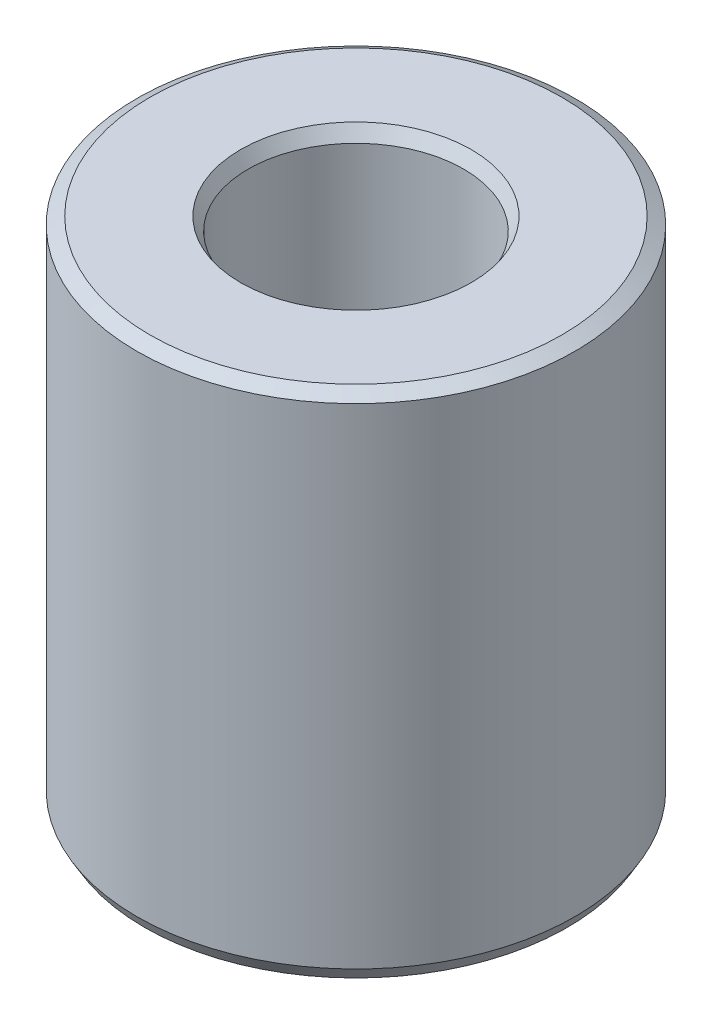
ISO-10303-21;
HEADER;
FILE_DESCRIPTION(('STEP AP214'),'2;1');
FILE_NAME('part.step','',(''),(''),'','','');
FILE_SCHEMA(('AUTOMOTIVE_DESIGN { 1 0 10303 214 1 1 1 1 }'));
ENDSEC;
DATA;
#1=APPLICATION_CONTEXT('core data for automotive mechanical design processes');
#2=APPLICATION_PROTOCOL_DEFINITION('international standard','automotive_design',2000,#1);
#3=PRODUCT_CONTEXT('',#1,'mechanical');
#4=PRODUCT('Part','Part','',(#3));
#5=PRODUCT_RELATED_PRODUCT_CATEGORY('part','',(#4));
#6=PRODUCT_DEFINITION_FORMATION('','',#4);
#7=PRODUCT_DEFINITION_CONTEXT('part definition',#1,'design');
#8=PRODUCT_DEFINITION('design','',#6,#7);
#9=PRODUCT_DEFINITION_SHAPE('','',#8);
#10=(LENGTH_UNIT() NAMED_UNIT(*) SI_UNIT(.MILLI.,.METRE.));
#11=(NAMED_UNIT(*) PLANE_ANGLE_UNIT() SI_UNIT($,.RADIAN.));
#12=(NAMED_UNIT(*) SI_UNIT($,.STERADIAN.) SOLID_ANGLE_UNIT());
#13=UNCERTAINTY_MEASURE_WITH_UNIT(LENGTH_MEASURE(1.E-05),#10,'distance_accuracy_value','');
#14=(GEOMETRIC_REPRESENTATION_CONTEXT(3) GLOBAL_UNCERTAINTY_ASSIGNED_CONTEXT((#13)) GLOBAL_UNIT_ASSIGNED_CONTEXT((#10,
#11,#12)) REPRESENTATION_CONTEXT('',''));
#15=CARTESIAN_POINT('',(0.,0.,0.));
#16=DIRECTION('',(0.,0.,1.));
#17=DIRECTION('',(1.,0.,0.));
#18=AXIS2_PLACEMENT_3D('',#15,#16,#17);
#19=CARTESIAN_POINT('',(0.,128.133976744386,0.));
#20=DIRECTION('',(0.,-1.,0.));
#21=DIRECTION('',(0.,0.,-1.));
#22=AXIS2_PLACEMENT_3D('',#19,#20,#21);
#23=CYLINDRICAL_SURFACE('',#22,55.);
#24=CARTESIAN_POINT('',(0.,3.2944253566551,0.));
#25=DIRECTION('',(0.,1.,0.));
#26=DIRECTION('',(0.,0.,1.));
#27=AXIS2_PLACEMENT_3D('',#24,#25,#26);
#28=CIRCLE('',#27,55.);
#29=CARTESIAN_POINT('',(0.,3.2944253566551,55.));
#30=VERTEX_POINT('',#29);
#31=EDGE_CURVE('E10',#30,#30,#28,.T.);
#32=ORIENTED_EDGE('',*,*,#31,.T.);
#33=EDGE_LOOP('',(#32));
#34=FACE_BOUND('',#33,.T.);
#35=CARTESIAN_POINT('',(0.,126.231939377896,0.));
#36=DIRECTION('',(0.,1.,0.));
#37=DIRECTION('',(0.,0.,1.));
#38=AXIS2_PLACEMENT_3D('',#35,#36,#37);
#39=CIRCLE('',#38,55.);
#40=CARTESIAN_POINT('',(0.,126.231939377896,55.));
#41=VERTEX_POINT('',#40);
#42=EDGE_CURVE('E50',#41,#41,#39,.F.);
#43=ORIENTED_EDGE('',*,*,#42,.T.);
#44=EDGE_LOOP('',(#43));
#45=FACE_BOUND('',#44,.T.);
#46=ADVANCED_FACE('F39',(#34,#45),#23,.T.);
#47=CARTESIAN_POINT('',(0.,128.133976744386,0.));
#48=DIRECTION('',(0.,1.,0.));
#49=DIRECTION('',(0.,0.,1.));
#50=AXIS2_PLACEMENT_3D('',#47,#48,#49);
#51=PLANE('',#50);
#52=CARTESIAN_POINT('',(0.,128.133976744386,0.));
#53=DIRECTION('',(0.,1.,0.));
#54=DIRECTION('',(0.,0.,1.));
#55=AXIS2_PLACEMENT_3D('',#52,#53,#54);
#56=CIRCLE('',#55,28.959207720593);
#57=CARTESIAN_POINT('',(0.,128.133976744386,28.959207720593));
#58=VERTEX_POINT('',#57);
#59=EDGE_CURVE('E58',#58,#58,#56,.F.);
#60=ORIENTED_EDGE('',*,*,#59,.T.);
#61=EDGE_LOOP('',(#60));
#62=FACE_BOUND('',#61,.T.);
#63=CARTESIAN_POINT('',(0.,128.133976744386,0.));
#64=DIRECTION('',(0.,1.,0.));
#65=DIRECTION('',(0.,0.,1.));
#66=AXIS2_PLACEMENT_3D('',#63,#64,#65);
#67=CIRCLE('',#66,51.7055746433449);
#68=CARTESIAN_POINT('',(0.,128.133976744386,51.7055746433449));
#69=VERTEX_POINT('',#68);
#70=EDGE_CURVE('E61',#69,#69,#67,.T.);
#71=ORIENTED_EDGE('',*,*,#70,.T.);
#72=EDGE_LOOP('',(#71));
#73=FACE_BOUND('',#72,.T.);
#74=ADVANCED_FACE('F88',(#62,#73),#51,.T.);
#75=CARTESIAN_POINT('',(0.,0.,0.));
#76=DIRECTION('',(0.,1.,0.));
#77=DIRECTION('',(0.,0.,1.));
#78=AXIS2_PLACEMENT_3D('',#75,#76,#77);
#79=PLANE('',#78);
#80=CARTESIAN_POINT('',(0.,0.,0.));
#81=DIRECTION('',(0.,1.,0.));
#82=DIRECTION('',(0.,0.,1.));
#83=AXIS2_PLACEMENT_3D('',#80,#81,#82);
#84=CIRCLE('',#83,30.3515957107582);
#85=CARTESIAN_POINT('',(0.,0.,30.3515957107582));
#86=VERTEX_POINT('',#85);
#87=EDGE_CURVE('E51',#86,#86,#84,.T.);
#88=ORIENTED_EDGE('',*,*,#87,.T.);
#89=EDGE_LOOP('',(#88));
#90=FACE_BOUND('',#89,.T.);
#91=CARTESIAN_POINT('',(0.,0.,0.));
#92=DIRECTION('',(0.,1.,0.));
#93=DIRECTION('',(0.,0.,1.));
#94=AXIS2_PLACEMENT_3D('',#91,#92,#93);
#95=CIRCLE('',#94,53.09796263351);
#96=CARTESIAN_POINT('',(0.,0.,53.09796263351));
#97=VERTEX_POINT('',#96);
#98=EDGE_CURVE('E54',#97,#97,#95,.F.);
#99=ORIENTED_EDGE('',*,*,#98,.T.);
#100=EDGE_LOOP('',(#99));
#101=FACE_BOUND('',#100,.T.);
#102=ADVANCED_FACE('F83',(#90,#101),#79,.F.);
#103=CARTESIAN_POINT('',(0.,128.133976744386,0.));
#104=DIRECTION('',(0.,-1.,0.));
#105=DIRECTION('',(0.,0.,-1.));
#106=AXIS2_PLACEMENT_3D('',#103,#104,#105);
#107=CYLINDRICAL_SURFACE('',#106,27.0571703541031);
#108=CARTESIAN_POINT('',(0.,124.839551387731,0.));
#109=DIRECTION('',(0.,1.,0.));
#110=DIRECTION('',(0.,0.,1.));
#111=AXIS2_PLACEMENT_3D('',#108,#109,#110);
#112=CIRCLE('',#111,27.0571703541031);
#113=CARTESIAN_POINT('',(0.,124.83955138773,27.0571703541031));
#114=VERTEX_POINT('',#113);
#115=EDGE_CURVE('E67',#114,#114,#112,.T.);
#116=ORIENTED_EDGE('',*,*,#115,.T.);
#117=EDGE_LOOP('',(#116));
#118=FACE_BOUND('',#117,.T.);
#119=CARTESIAN_POINT('',(0.,1.90203736648994,0.));
#120=DIRECTION('',(0.,1.,0.));
#121=DIRECTION('',(0.,0.,1.));
#122=AXIS2_PLACEMENT_3D('',#119,#120,#121);
#123=CIRCLE('',#122,27.0571703541031);
#124=CARTESIAN_POINT('',(0.,1.90203736648994,27.0571703541031));
#125=VERTEX_POINT('',#124);
#126=EDGE_CURVE('E69',#125,#125,#123,.F.);
#127=ORIENTED_EDGE('',*,*,#126,.T.);
#128=EDGE_LOOP('',(#127));
#129=FACE_BOUND('',#128,.T.);
#130=ADVANCED_FACE('F71',(#118,#129),#107,.F.);
#131=CARTESIAN_POINT('',(0.,124.839551387731,0.));
#132=DIRECTION('',(0.,1.,0.));
#133=DIRECTION('',(0.,0.,1.));
#134=AXIS2_PLACEMENT_3D('',#131,#132,#133);
#135=CONICAL_SURFACE('',#134,27.0571703541031,0.523598775598299);
#136=CARTESIAN_POINT('',(0.,128.133976744386,28.959207720593));
#137=CARTESIAN_POINT('',(0.,128.099659813587,28.9393948313588));
#138=CARTESIAN_POINT('',(0.,128.065342882789,28.9195819421245));
#139=CARTESIAN_POINT('',(0.,127.996709021192,28.8799561636559));
#140=CARTESIAN_POINT('',(0.,127.962392090393,28.8601432744217));
#141=CARTESIAN_POINT('',(0.,127.893758228796,28.8205174959531));
#142=CARTESIAN_POINT('',(0.,127.859441297998,28.8007046067189));
#143=CARTESIAN_POINT('',(0.,127.790807436401,28.7610788282503));
#144=CARTESIAN_POINT('',(0.,127.756490505602,28.741265939016));
#145=CARTESIAN_POINT('',(0.,127.687856644005,28.7016401605475));
#146=CARTESIAN_POINT('',(0.,127.653539713207,28.6818272713132));
#147=CARTESIAN_POINT('',(0.,127.58490585161,28.6422014928447));
#148=CARTESIAN_POINT('',(0.,127.550588920811,28.6223886036104));
#149=CARTESIAN_POINT('',(0.,127.481955059214,28.5827628251419));
#150=CARTESIAN_POINT('',(0.,127.447638128416,28.5629499359076));
#151=CARTESIAN_POINT('',(0.,127.379004266819,28.5233241574391));
#152=CARTESIAN_POINT('',(0.,127.34468733602,28.5035112682048));
#153=CARTESIAN_POINT('',(0.,127.276053474423,28.4638854897363));
#154=CARTESIAN_POINT('',(0.,127.241736543625,28.444072600502));
#155=CARTESIAN_POINT('',(0.,127.173102682028,28.4044468220335));
#156=CARTESIAN_POINT('',(0.,127.138785751229,28.3846339327992));
#157=CARTESIAN_POINT('',(0.,127.070151889632,28.3450081543306));
#158=CARTESIAN_POINT('',(0.,127.035834958834,28.3251952650964));
#159=CARTESIAN_POINT('',(0.,126.967201097237,28.2855694866278));
#160=CARTESIAN_POINT('',(0.,126.932884166438,28.2657565973936));
#161=CARTESIAN_POINT('',(0.,126.864250304841,28.226130818925));
#162=CARTESIAN_POINT('',(0.,126.829933374043,28.2063179296907));
#163=CARTESIAN_POINT('',(0.,126.761299512446,28.1666921512222));
#164=CARTESIAN_POINT('',(0.,126.726982581647,28.1468792619879));
#165=CARTESIAN_POINT('',(0.,126.65834872005,28.1072534835194));
#166=CARTESIAN_POINT('',(0.,126.624031789252,28.0874405942851));
#167=CARTESIAN_POINT('',(0.,126.555397927655,28.0478148158166));
#168=CARTESIAN_POINT('',(0.,126.521080996857,28.0280019265823));
#169=CARTESIAN_POINT('',(0.,126.45244713526,27.9883761481138));
#170=CARTESIAN_POINT('',(0.,126.418130204461,27.9685632588795));
#171=CARTESIAN_POINT('',(0.,126.349496342864,27.928937480411));
#172=CARTESIAN_POINT('',(0.,126.315179412066,27.9091245911767));
#173=CARTESIAN_POINT('',(0.,126.246545550469,27.8694988127082));
#174=CARTESIAN_POINT('',(0.,126.21222861967,27.8496859234739));
#175=CARTESIAN_POINT('',(0.,126.143594758073,27.8100601450053));
#176=CARTESIAN_POINT('',(0.,126.109277827275,27.7902472557711));
#177=CARTESIAN_POINT('',(0.,126.040643965678,27.7506214773025));
#178=CARTESIAN_POINT('',(0.,126.006327034879,27.7308085880683));
#179=CARTESIAN_POINT('',(0.,125.937693173282,27.6911828095997));
#180=CARTESIAN_POINT('',(0.,125.903376242484,27.6713699203654));
#181=CARTESIAN_POINT('',(0.,125.834742380887,27.6317441418969));
#182=CARTESIAN_POINT('',(0.,125.800425450088,27.6119312526626));
#183=CARTESIAN_POINT('',(0.,125.731791588491,27.5723054741941));
#184=CARTESIAN_POINT('',(0.,125.697474657693,27.5524925849598));
#185=CARTESIAN_POINT('',(0.,125.628840796096,27.5128668064913));
#186=CARTESIAN_POINT('',(0.,125.594523865297,27.493053917257));
#187=CARTESIAN_POINT('',(0.,125.5258900037,27.4534281387885));
#188=CARTESIAN_POINT('',(0.,125.491573072902,27.4336152495542));
#189=CARTESIAN_POINT('',(0.,125.422939211305,27.3939894710857));
#190=CARTESIAN_POINT('',(0.,125.388622280506,27.3741765818514));
#191=CARTESIAN_POINT('',(0.,125.319988418909,27.3345508033829));
#192=CARTESIAN_POINT('',(0.,125.285671488111,27.3147379141486));
#193=CARTESIAN_POINT('',(0.,125.217037626514,27.27511213568));
#194=CARTESIAN_POINT('',(0.,125.182720695715,27.2552992464458));
#195=CARTESIAN_POINT('',(0.,125.114086834118,27.2156734679772));
#196=CARTESIAN_POINT('',(0.,125.07976990332,27.195860578743));
#197=CARTESIAN_POINT('',(0.,125.011136041723,27.1562348002744));
#198=CARTESIAN_POINT('',(0.,124.976819110924,27.1364219110402));
#199=CARTESIAN_POINT('',(0.,124.908185249327,27.0967961325716));
#200=CARTESIAN_POINT('',(0.,124.873868318529,27.0769832433373));
#201=CARTESIAN_POINT('',(0.,124.839551387731,27.0571703541031));
#202=B_SPLINE_CURVE_WITH_KNOTS('',3,(#136,#137,#138,#139,#140,#141,#142,#143,#144,#145,#146,
#147,#148,#149,#150,#151,#152,#153,#154,#155,#156,#157,#158,#159,#160,#161,#162,#163,#164,#165,
#166,#167,#168,#169,#170,#171,#172,#173,#174,#175,#176,#177,#178,#179,#180,#181,#182,#183,#184,
#185,#186,#187,#188,#189,#190,#191,#192,#193,#194,#195,#196,#197,#198,#199,#200,#201),
.UNSPECIFIED.,.F.,.F.,(4,2,2,2,2,2,2,2,2,2,2,2,2,2,2,2,2,2,2,2,2,2,2,2,2,2,2,2,2,2,2,2,4),(0.,
0.118877335405623,0.237754670811247,0.35663200621687,0.475509341622493,0.594386677028115,
0.713264012433738,0.832141347839361,0.951018683244985,1.06989601865061,1.18877335405623,
1.30765068946185,1.42652802486748,1.5454053602731,1.66428269567872,1.78316003108435,
1.90203736648997,2.02091470189559,2.13979203730121,2.25866937270684,2.37754670811246,
2.49642404351808,2.61530137892371,2.73417871432933,2.85305604973495,2.97193338514058,
3.09081072054618,3.2096880559518,3.32856539135742,3.44744272676304,3.56632006216867,
3.6851973975743,3.80407473297991),.UNSPECIFIED.);
#203=EDGE_CURVE('BSEAM77',#58,#114,#202,.T.);
#204=ORIENTED_EDGE('',*,*,#59,.F.);
#205=ORIENTED_EDGE('',*,*,#115,.F.);
#206=ORIENTED_EDGE('',*,*,#203,.T.);
#207=ORIENTED_EDGE('',*,*,#203,.F.);
#208=EDGE_LOOP('',(#204,#206,#205,#207));
#209=FACE_BOUND('',#208,.T.);
#210=ADVANCED_FACE('F77',(#209),#135,.F.);
#211=CARTESIAN_POINT('',(0.,0.,0.));
#212=DIRECTION('',(0.,-1.,0.));
#213=DIRECTION('',(0.,0.,-1.));
#214=AXIS2_PLACEMENT_3D('',#211,#212,#213);
#215=CONICAL_SURFACE('',#214,30.3515957107582,1.0471975511966);
#216=ORIENTED_EDGE('',*,*,#126,.F.);
#217=EDGE_LOOP('',(#216));
#218=FACE_BOUND('',#217,.T.);
#219=ORIENTED_EDGE('',*,*,#87,.F.);
#220=EDGE_LOOP('',(#219));
#221=FACE_BOUND('',#220,.T.);
#222=ADVANCED_FACE('F73',(#218,#221),#215,.F.);
#223=CARTESIAN_POINT('',(0.,3.2944253566551,0.));
#224=DIRECTION('',(0.,1.,0.));
#225=DIRECTION('',(0.,0.,1.));
#226=AXIS2_PLACEMENT_3D('',#223,#224,#225);
#227=CONICAL_SURFACE('',#226,55.,0.523598775598302);
#228=ORIENTED_EDGE('',*,*,#98,.F.);
#229=EDGE_LOOP('',(#228));
#230=FACE_BOUND('',#229,.T.);
#231=ORIENTED_EDGE('',*,*,#31,.F.);
#232=EDGE_LOOP('',(#231));
#233=FACE_BOUND('',#232,.T.);
#234=ADVANCED_FACE('F76',(#230,#233),#227,.T.);
#235=CARTESIAN_POINT('',(0.,128.133976744386,0.));
#236=DIRECTION('',(0.,-1.,0.));
#237=DIRECTION('',(0.,0.,-1.));
#238=AXIS2_PLACEMENT_3D('',#235,#236,#237);
#239=CONICAL_SURFACE('',#238,51.7055746433449,1.0471975511966);
#240=ORIENTED_EDGE('',*,*,#42,.F.);
#241=EDGE_LOOP('',(#240));
#242=FACE_BOUND('',#241,.T.);
#243=ORIENTED_EDGE('',*,*,#70,.F.);
#244=EDGE_LOOP('',(#243));
#245=FACE_BOUND('',#244,.T.);
#246=ADVANCED_FACE('F45',(#242,#245),#239,.T.);
#247=CLOSED_SHELL('',(#46,#74,#102,#130,#210,#222,#234,#246));
#248=MANIFOLD_SOLID_BREP('B2',#247);
#249=ADVANCED_BREP_SHAPE_REPRESENTATION('',(#18,#248),#14);
#250=SHAPE_DEFINITION_REPRESENTATION(#9,#249);
ENDSEC;
END-ISO-10303-21;
